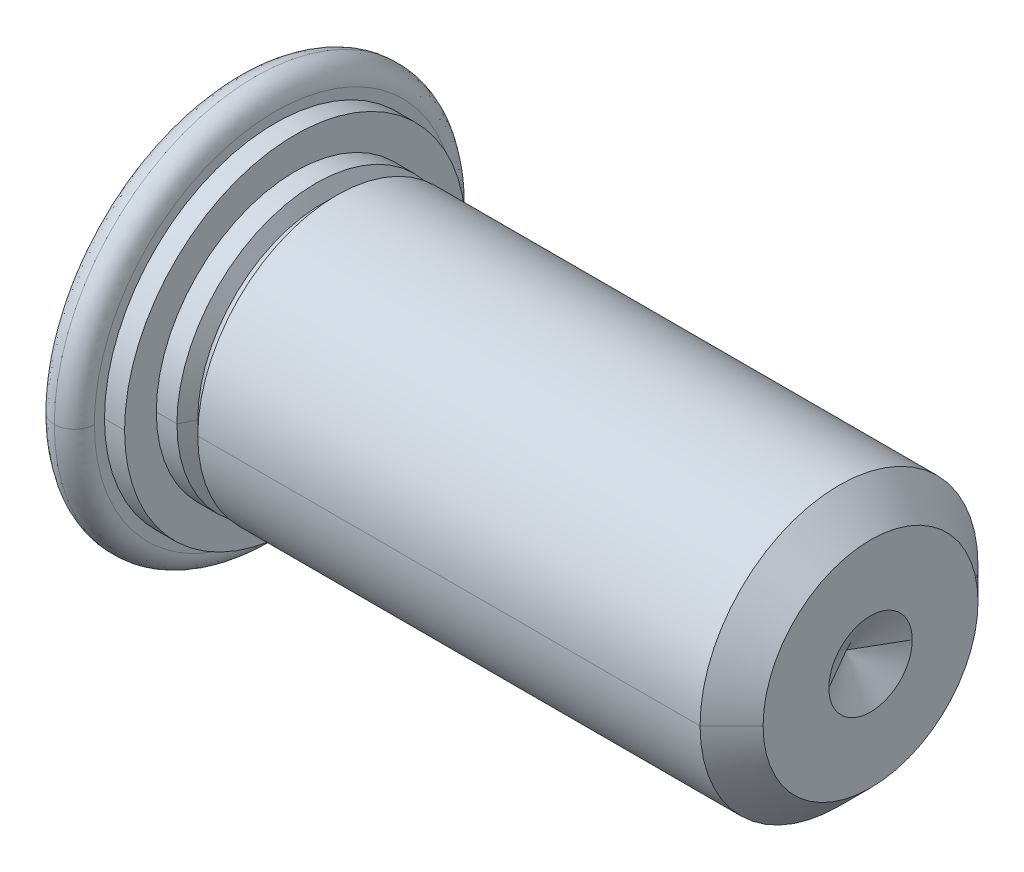
ISO-10303-21;
HEADER;
FILE_DESCRIPTION(('STEP AP214'),'2;1');
FILE_NAME('part.step','',(''),(''),'','','');
FILE_SCHEMA(('AUTOMOTIVE_DESIGN { 1 0 10303 214 1 1 1 1 }'));
ENDSEC;
DATA;
#1=APPLICATION_CONTEXT('core data for automotive mechanical design processes');
#2=APPLICATION_PROTOCOL_DEFINITION('international standard','automotive_design',2000,#1);
#3=PRODUCT_CONTEXT('',#1,'mechanical');
#4=PRODUCT('Part','Part','',(#3));
#5=PRODUCT_RELATED_PRODUCT_CATEGORY('part','',(#4));
#6=PRODUCT_DEFINITION_FORMATION('','',#4);
#7=PRODUCT_DEFINITION_CONTEXT('part definition',#1,'design');
#8=PRODUCT_DEFINITION('design','',#6,#7);
#9=PRODUCT_DEFINITION_SHAPE('','',#8);
#10=(LENGTH_UNIT() NAMED_UNIT(*) SI_UNIT(.MILLI.,.METRE.));
#11=(NAMED_UNIT(*) PLANE_ANGLE_UNIT() SI_UNIT($,.RADIAN.));
#12=(NAMED_UNIT(*) SI_UNIT($,.STERADIAN.) SOLID_ANGLE_UNIT());
#13=UNCERTAINTY_MEASURE_WITH_UNIT(LENGTH_MEASURE(1.E-05),#10,'distance_accuracy_value','');
#14=(GEOMETRIC_REPRESENTATION_CONTEXT(3) GLOBAL_UNCERTAINTY_ASSIGNED_CONTEXT((#13)) GLOBAL_UNIT_ASSIGNED_CONTEXT((#10,
#11,#12)) REPRESENTATION_CONTEXT('',''));
#15=CARTESIAN_POINT('',(0.,0.,0.));
#16=DIRECTION('',(0.,0.,1.));
#17=DIRECTION('',(1.,0.,0.));
#18=AXIS2_PLACEMENT_3D('',#15,#16,#17);
#19=CARTESIAN_POINT('',(1.41985999933917,0.,1.87452000255141));
#20=CARTESIAN_POINT('',(1.41985999933918,3.74904000510282,1.87452000255141));
#21=CARTESIAN_POINT('',(1.41985999933918,3.74904000510282,-1.87452000255141));
#22=CARTESIAN_POINT('',(1.41985999933917,0.,-1.87452000255141));
#23=CARTESIAN_POINT('',(1.38684894271597,0.,1.85546106044628));
#24=CARTESIAN_POINT('',(1.38684894271597,3.71092212089255,1.85546106044628));
#25=CARTESIAN_POINT('',(1.38684894271597,3.71092212089255,-1.85546106044628));
#26=CARTESIAN_POINT('',(1.38684894271597,0.,-1.85546106044628));
#27=CARTESIAN_POINT('',(1.34873105802194,0.,1.85546106031754));
#28=CARTESIAN_POINT('',(1.34873105802194,3.71092212063508,1.85546106031754));
#29=CARTESIAN_POINT('',(1.34873105802194,3.71092212063508,-1.85546106031754));
#30=CARTESIAN_POINT('',(1.34873105802194,0.,-1.85546106031754));
#31=CARTESIAN_POINT('',(1.31572000127,0.,1.87452000219971));
#32=CARTESIAN_POINT('',(1.31572000127,3.74904000439941,1.8745200021997));
#33=CARTESIAN_POINT('',(1.31572000127,3.74904000439941,-1.8745200021997));
#34=CARTESIAN_POINT('',(1.31572000127,0.,-1.87452000219971));
#35=(BOUNDED_SURFACE() B_SPLINE_SURFACE(3,3,((#19,#20,#21,#22),(#23,#24,#25,#26),(#27,#28,#29,
#30),(#31,#32,#33,#34)),.UNSPECIFIED.,.F.,.F.,.F.) B_SPLINE_SURFACE_WITH_KNOTS((4,4),(4,4),(0.,
1.),(0.,1.),.UNSPECIFIED.) GEOMETRIC_REPRESENTATION_ITEM() RATIONAL_B_SPLINE_SURFACE(((1.,
0.333333333333334,0.333333333333334,1.),(0.910683606091115,0.303561202030372,0.303561202030372,
0.910683606091115),(0.910683606091115,0.303561202030372,0.303561202030372,0.910683606091115),
(1.,0.333333333333334,0.333333333333334,1.))) REPRESENTATION_ITEM('') SURFACE());
#36=CARTESIAN_POINT('',(1.41985999997019,0.,0.));
#37=DIRECTION('',(1.,0.,0.));
#38=DIRECTION('',(0.,0.,-1.));
#39=AXIS2_PLACEMENT_3D('',#36,#37,#38);
#40=CIRCLE('',#39,1.87452000000121);
#41=CARTESIAN_POINT('',(1.41985999997019,0.,-1.87452000145847));
#42=VERTEX_POINT('',#41);
#43=CARTESIAN_POINT('',(1.41985999997019,1.87452000000121,0.));
#44=VERTEX_POINT('',#43);
#45=EDGE_CURVE('E41',#42,#44,#40,.T.);
#46=CARTESIAN_POINT('',(1.36779,0.,-1.96470788848305));
#47=DIRECTION('',(0.,-1.,0.));
#48=DIRECTION('',(0.,0.,-1.));
#49=AXIS2_PLACEMENT_3D('',#46,#47,#48);
#50=CIRCLE('',#49,0.10414);
#51=CARTESIAN_POINT('',(1.31572000127,0.,-1.87452000219971));
#52=VERTEX_POINT('',#51);
#53=EDGE_CURVE('E11',#42,#52,#50,.T.);
#54=CARTESIAN_POINT('',(1.31572000127,0.,0.));
#55=DIRECTION('',(-1.,0.,0.));
#56=DIRECTION('',(0.,0.,1.));
#57=AXIS2_PLACEMENT_3D('',#54,#55,#56);
#58=CIRCLE('',#57,1.87452000219971);
#59=CARTESIAN_POINT('',(1.31572000127,0.,1.87452000219971));
#60=VERTEX_POINT('',#59);
#61=EDGE_CURVE('E190',#60,#52,#58,.T.);
#62=CARTESIAN_POINT('',(1.36779,0.,1.96470788848305));
#63=DIRECTION('',(0.,1.,0.));
#64=DIRECTION('',(0.,0.,1.));
#65=AXIS2_PLACEMENT_3D('',#62,#63,#64);
#66=CIRCLE('',#65,0.10414);
#67=CARTESIAN_POINT('',(1.41985999997019,0.,1.87452000145847));
#68=VERTEX_POINT('',#67);
#69=EDGE_CURVE('E210',#68,#60,#66,.T.);
#70=CARTESIAN_POINT('',(1.41985999997019,0.,0.));
#71=DIRECTION('',(1.,0.,0.));
#72=DIRECTION('',(0.,0.,-1.));
#73=AXIS2_PLACEMENT_3D('',#70,#71,#72);
#74=CIRCLE('',#73,1.87452000000121);
#75=EDGE_CURVE('E186',#44,#68,#74,.T.);
#76=ORIENTED_EDGE('',*,*,#45,.F.);
#77=ORIENTED_EDGE('',*,*,#53,.T.);
#78=ORIENTED_EDGE('',*,*,#61,.F.);
#79=ORIENTED_EDGE('',*,*,#69,.F.);
#80=ORIENTED_EDGE('',*,*,#75,.F.);
#81=EDGE_LOOP('',(#76,#77,#78,#79,#80));
#82=FACE_BOUND('',#81,.T.);
#83=ADVANCED_FACE('F16',(#82),#35,.F.);
#84=CARTESIAN_POINT('',(0.30099,0.,-3.00993910280277));
#85=CARTESIAN_POINT('',(0.30099,-6.01987820560554,-3.00993910280277));
#86=CARTESIAN_POINT('',(0.30099,-6.01987820560554,3.00993910280277));
#87=CARTESIAN_POINT('',(0.30099,0.,3.00993910280277));
#88=CARTESIAN_POINT('',(0.47732402232425,0.,-3.00993910280277));
#89=CARTESIAN_POINT('',(0.477324022324249,-6.01987820560552,-3.00993910280277));
#90=CARTESIAN_POINT('',(0.477324022324249,-6.01987820560552,3.00993910280276));
#91=CARTESIAN_POINT('',(0.47732402232425,0.,3.00993910280277));
#92=CARTESIAN_POINT('',(0.60200290571081,0.,-2.88524402083668));
#93=CARTESIAN_POINT('',(0.602002905710809,-5.77048804167335,-2.88524402083668));
#94=CARTESIAN_POINT('',(0.602002905710809,-5.77048804167335,2.88524402083668));
#95=CARTESIAN_POINT('',(0.60200290571081,0.,2.88524402083668));
#96=CARTESIAN_POINT('',(0.60197999746,0.,-2.70891000000048));
#97=CARTESIAN_POINT('',(0.60197999746,-5.41782000000096,-2.70891000000048));
#98=CARTESIAN_POINT('',(0.60197999746,-5.41782000000097,2.70891000000048));
#99=CARTESIAN_POINT('',(0.60197999746,0.,2.70891000000048));
#100=(BOUNDED_SURFACE() B_SPLINE_SURFACE(3,3,((#84,#85,#86,#87),(#88,#89,#90,#91),(#92,#93,#94,
#95),(#96,#97,#98,#99)),.UNSPECIFIED.,.F.,.F.,.F.) B_SPLINE_SURFACE_WITH_KNOTS((4,4),(4,4),(0.,
1.),(0.,1.),.UNSPECIFIED.) GEOMETRIC_REPRESENTATION_ITEM() RATIONAL_B_SPLINE_SURFACE(((1.,
0.333333333333334,0.333333333333334,1.),(0.804707232116165,0.268235744038722,0.268235744038722,
0.804707232116165),(0.804707232116165,0.268235744038722,0.268235744038722,0.804707232116165),
(1.,0.333333333333334,0.333333333333334,1.))) REPRESENTATION_ITEM('') SURFACE());
#101=CARTESIAN_POINT('',(0.30099,0.,0.));
#102=DIRECTION('',(-1.,0.,0.));
#103=DIRECTION('',(0.,0.,1.));
#104=AXIS2_PLACEMENT_3D('',#101,#102,#103);
#105=CIRCLE('',#104,3.00993910280277);
#106=CARTESIAN_POINT('',(0.30099,0.,-3.00993910280277));
#107=VERTEX_POINT('',#106);
#108=CARTESIAN_POINT('',(0.30099,0.,3.00993910280277));
#109=VERTEX_POINT('',#108);
#110=EDGE_CURVE('E198',#107,#109,#105,.T.);
#111=CARTESIAN_POINT('',(0.30099,0.,-2.70894910280277));
#112=DIRECTION('',(0.,-1.,0.));
#113=DIRECTION('',(0.,0.,-1.));
#114=AXIS2_PLACEMENT_3D('',#111,#112,#113);
#115=CIRCLE('',#114,0.30099);
#116=CARTESIAN_POINT('',(0.601979997968,0.,-2.70891000000042));
#117=VERTEX_POINT('',#116);
#118=EDGE_CURVE('E27',#107,#117,#115,.T.);
#119=CARTESIAN_POINT('',(0.601979997968,0.,2.70891000000042));
#120=CARTESIAN_POINT('',(0.60197999873,-0.172146495770327,2.70891000000033));
#121=CARTESIAN_POINT('',(0.60197999873,-0.425898297557994,2.6851353533292));
#122=CARTESIAN_POINT('',(0.60197999873,-0.714123168041582,2.61579263387176));
#123=CARTESIAN_POINT('',(0.60197999873,-0.856280878716203,2.57071986622442));
#124=CARTESIAN_POINT('',(0.60197999873,-0.91678674231236,2.54917409267871));
#125=CARTESIAN_POINT('',(0.60197999873,-0.957030902587552,2.53431493850926));
#126=CARTESIAN_POINT('',(0.60197999873,-0.975419148248615,2.52730532096344));
#127=CARTESIAN_POINT('',(0.60197999873,-1.34459610257155,2.38123291731776));
#128=CARTESIAN_POINT('',(0.60197999873,-1.65121072516083,2.17966149054652));
#129=CARTESIAN_POINT('',(0.60197999873,-2.04762758335602,1.78340220066317));
#130=CARTESIAN_POINT('',(0.60197999873,-2.2221348224057,1.56954322932422));
#131=CARTESIAN_POINT('',(0.60197999873,-2.38424951871313,1.2925147749002));
#132=CARTESIAN_POINT('',(0.60197999873,-2.45493759622089,1.14711896738939));
#133=CARTESIAN_POINT('',(0.60197999873,-2.48301050001436,1.08333185410644));
#134=CARTESIAN_POINT('',(0.60197999873,-2.50123199441735,1.04047941761787));
#135=CARTESIAN_POINT('',(0.60197999873,-2.51079216389402,1.017131488907));
#136=CARTESIAN_POINT('',(0.60197999873,-2.64544343042842,0.677198652037437));
#137=CARTESIAN_POINT('',(0.60197999873,-2.70884262477299,0.34412271036082));
#138=CARTESIAN_POINT('',(0.60197999873,-2.70894368761399,-0.17206135518041));
#139=CARTESIAN_POINT('',(0.60197999873,-2.68519430665312,-0.425749301525639));
#140=CARTESIAN_POINT('',(0.60197999873,-2.61583684886469,-0.714011421017316));
#141=CARTESIAN_POINT('',(0.60197999873,-2.57074565830363,-0.856215692952048));
#142=CARTESIAN_POINT('',(0.60197999873,-2.54918962056314,-0.916747497821696));
#143=CARTESIAN_POINT('',(0.60197999873,-2.53432309722819,-0.957010282600932));
#144=CARTESIAN_POINT('',(0.60197999873,-2.52730532096344,-0.975419148248602));
#145=CARTESIAN_POINT('',(0.60197999873,-2.38123291731771,-1.34459610257174));
#146=CARTESIAN_POINT('',(0.60197999873,-2.17966149054589,-1.65121072516161));
#147=CARTESIAN_POINT('',(0.60197999873,-1.78340220066348,-2.04762758335563));
#148=CARTESIAN_POINT('',(0.60197999873,-1.56954322932476,-2.22213482240501));
#149=CARTESIAN_POINT('',(0.60197999873,-1.29251477490062,-2.38424951871262));
#150=CARTESIAN_POINT('',(0.601979998730001,-1.14711896738963,-2.45493759622059));
#151=CARTESIAN_POINT('',(0.60197999873,-1.08333185410659,-2.48301050001418));
#152=CARTESIAN_POINT('',(0.60197999873,-1.04047941761794,-2.50123199441725));
#153=CARTESIAN_POINT('',(0.60197999873,-1.01714214117938,-2.51078794440763));
#154=CARTESIAN_POINT('',(0.60197999873,-0.677028215679255,-2.64551094221066));
#155=CARTESIAN_POINT('',(0.60197999873,-0.34464973578613,-2.70891000000033));
#156=CARTESIAN_POINT('',(0.601979997968,0.,-2.70891000000042));
#157=(BOUNDED_CURVE() B_SPLINE_CURVE(3,(#119,#120,#121,#122,#123,#124,#125,#126,#127,#128,#129,
#130,#131,#132,#133,#134,#135,#136,#137,#138,#139,#140,#141,#142,#143,#144,#145,#146,#147,#148,
#149,#150,#151,#152,#153,#154,#155,#156),.UNSPECIFIED.,.F.,.F.) B_SPLINE_CURVE_WITH_KNOTS((4,1,
1,1,2,2,2,1,1,1,2,2,2,1,1,1,2,2,2,1,1,1,2,2,4),(0.,0.0625,0.09375,0.109375,0.1171875,0.125,0.25,
0.3125,0.34375,0.359375,0.3671875,0.375,0.5,0.5625,0.59375,0.609375,0.6171875,0.625,0.75,0.8125,
0.84375,0.859375,0.8671875,0.875,1.),
.UNSPECIFIED.) CURVE() GEOMETRIC_REPRESENTATION_ITEM() RATIONAL_B_SPLINE_CURVE((1.,1.,1.,1.,1.,
1.,1.,1.,1.,1.,1.,1.,1.,1.,1.,1.,1.,1.,1.,1.,1.,1.,1.,1.,1.,1.,1.,1.,1.,1.,1.,1.,1.,1.,1.,1.,1.,1.)) REPRESENTATION_ITEM(''));
#158=CARTESIAN_POINT('',(0.601979997968,0.,2.70891000000042));
#159=VERTEX_POINT('',#158);
#160=EDGE_CURVE('E203',#159,#117,#157,.T.);
#161=CARTESIAN_POINT('',(0.30099,0.,2.70894910280277));
#162=DIRECTION('',(0.,1.,0.));
#163=DIRECTION('',(0.,0.,1.));
#164=AXIS2_PLACEMENT_3D('',#161,#162,#163);
#165=CIRCLE('',#164,0.30099);
#166=EDGE_CURVE('E200',#109,#159,#165,.T.);
#167=ORIENTED_EDGE('',*,*,#110,.F.);
#168=ORIENTED_EDGE('',*,*,#118,.T.);
#169=ORIENTED_EDGE('',*,*,#160,.F.);
#170=ORIENTED_EDGE('',*,*,#166,.F.);
#171=EDGE_LOOP('',(#167,#168,#169,#170));
#172=FACE_BOUND('',#171,.T.);
#173=ADVANCED_FACE('F365',(#172),#100,.T.);
#174=CARTESIAN_POINT('',(2.54000011128131E-09,0.,-2.70891000000033));
#175=CARTESIAN_POINT('',(2.5400001112813E-09,-5.41782000000066,-2.70891000000033));
#176=CARTESIAN_POINT('',(2.53999977954646E-09,-5.41782000000066,2.70891000000033));
#177=CARTESIAN_POINT('',(2.53999977954647E-09,0.,2.70891000000033));
#178=CARTESIAN_POINT('',(-2.29057108997583E-05,0.,-2.8852440208366));
#179=CARTESIAN_POINT('',(-2.29057108997583E-05,-5.77048804167319,-2.8852440208366));
#180=CARTESIAN_POINT('',(-2.29057109001116E-05,-5.77048804167319,2.8852440208366));
#181=CARTESIAN_POINT('',(-2.29057109001116E-05,0.,2.8852440208366));
#182=CARTESIAN_POINT('',(0.12465597767568,0.,-3.00993910280277));
#183=CARTESIAN_POINT('',(0.124655977675679,-6.01987820560553,-3.00993910280277));
#184=CARTESIAN_POINT('',(0.124655977675679,-6.01987820560553,3.00993910280277));
#185=CARTESIAN_POINT('',(0.124655977675679,0.,3.00993910280277));
#186=CARTESIAN_POINT('',(0.30099,0.,-3.00993910280277));
#187=CARTESIAN_POINT('',(0.30099,-6.01987820560554,-3.00993910280277));
#188=CARTESIAN_POINT('',(0.30099,-6.01987820560554,3.00993910280277));
#189=CARTESIAN_POINT('',(0.30099,0.,3.00993910280277));
#190=(BOUNDED_SURFACE() B_SPLINE_SURFACE(3,3,((#174,#175,#176,#177),(#178,#179,#180,#181),(#182,
#183,#184,#185),(#186,#187,#188,#189)),.UNSPECIFIED.,.F.,.F.,
.F.) B_SPLINE_SURFACE_WITH_KNOTS((4,4),(4,4),(0.,1.),(0.,1.),
.UNSPECIFIED.) GEOMETRIC_REPRESENTATION_ITEM() RATIONAL_B_SPLINE_SURFACE(((1.,0.333333333333334,
0.333333333333334,1.),(0.804707232116045,0.268235744038682,0.268235744038682,0.804707232116045),
(0.804707232116045,0.268235744038682,0.268235744038682,0.804707232116045),(1.,0.333333333333334,
0.333333333333334,1.))) REPRESENTATION_ITEM('') SURFACE());
#191=CARTESIAN_POINT('',(1.52399987161239E-09,0.,2.7089100000002));
#192=CARTESIAN_POINT('',(2.53999978602065E-09,-5.41782000000066,2.70891000000033));
#193=CARTESIAN_POINT('',(2.5400001112813E-09,-5.41782000000066,-2.70891000000033));
#194=CARTESIAN_POINT('',(1.52400020205239E-09,0.,-2.7089100000002));
#195=(BOUNDED_CURVE() B_SPLINE_CURVE(3,(#191,#192,#193,#194),.UNSPECIFIED.,.F.,
.F.) B_SPLINE_CURVE_WITH_KNOTS((4,4),(0.,1.),
.UNSPECIFIED.) CURVE() GEOMETRIC_REPRESENTATION_ITEM() RATIONAL_B_SPLINE_CURVE((1.,
0.333333333333334,0.333333333333334,1.)) REPRESENTATION_ITEM(''));
#196=CARTESIAN_POINT('',(1.52399987161239E-09,0.,2.7089100000002));
#197=VERTEX_POINT('',#196);
#198=CARTESIAN_POINT('',(1.52400020205239E-09,0.,-2.7089100000002));
#199=VERTEX_POINT('',#198);
#200=EDGE_CURVE('E249',#197,#199,#195,.T.);
#201=CARTESIAN_POINT('',(0.30099,0.,-2.70894910280277));
#202=DIRECTION('',(0.,-1.,0.));
#203=DIRECTION('',(0.,0.,-1.));
#204=AXIS2_PLACEMENT_3D('',#201,#202,#203);
#205=CIRCLE('',#204,0.30099);
#206=EDGE_CURVE('E255',#199,#107,#205,.T.);
#207=CARTESIAN_POINT('',(0.30099,0.,2.70894910280277));
#208=DIRECTION('',(0.,1.,0.));
#209=DIRECTION('',(0.,0.,1.));
#210=AXIS2_PLACEMENT_3D('',#207,#208,#209);
#211=CIRCLE('',#210,0.30099);
#212=EDGE_CURVE('E308',#197,#109,#211,.T.);
#213=ORIENTED_EDGE('',*,*,#200,.T.);
#214=ORIENTED_EDGE('',*,*,#206,.T.);
#215=ORIENTED_EDGE('',*,*,#110,.T.);
#216=ORIENTED_EDGE('',*,*,#212,.F.);
#217=EDGE_LOOP('',(#213,#214,#215,#216));
#218=FACE_BOUND('',#217,.T.);
#219=ADVANCED_FACE('F375',(#218),#190,.T.);
#220=CARTESIAN_POINT('',(4.82727,0.,0.));
#221=DIRECTION('',(-1.,0.,0.));
#222=DIRECTION('',(0.,0.,1.));
#223=AXIS2_PLACEMENT_3D('',#220,#221,#222);
#224=CYLINDRICAL_SURFACE('',#223,2.0828);
#225=CARTESIAN_POINT('',(9.05256,0.,0.));
#226=DIRECTION('',(-1.,0.,0.));
#227=DIRECTION('',(0.,0.,1.));
#228=AXIS2_PLACEMENT_3D('',#225,#226,#227);
#229=CIRCLE('',#228,2.0828);
#230=CARTESIAN_POINT('',(9.05256,0.,2.08280000008253));
#231=VERTEX_POINT('',#230);
#232=CARTESIAN_POINT('',(9.05256,0.,-2.08280000008253));
#233=VERTEX_POINT('',#232);
#234=EDGE_CURVE('E194',#231,#233,#229,.T.);
#235=ORIENTED_EDGE('',*,*,#234,.T.);
#236=DIRECTION('',(-1.,0.,0.));
#237=VECTOR('',#236,1.);
#238=CARTESIAN_POINT('',(4.82727,0.,-2.0828));
#239=LINE('',#238,#237);
#240=CARTESIAN_POINT('',(1.524,0.,-2.0828));
#241=VERTEX_POINT('',#240);
#242=EDGE_CURVE('E199',#233,#241,#239,.T.);
#243=ORIENTED_EDGE('',*,*,#242,.T.);
#244=CARTESIAN_POINT('',(1.524,0.,0.));
#245=DIRECTION('',(1.,0.,0.));
#246=DIRECTION('',(0.,0.,1.));
#247=AXIS2_PLACEMENT_3D('',#244,#245,#246);
#248=CIRCLE('',#247,2.0828);
#249=CARTESIAN_POINT('',(1.524,2.08280000006084,0.));
#250=VERTEX_POINT('',#249);
#251=EDGE_CURVE('E185',#241,#250,#248,.T.);
#252=ORIENTED_EDGE('',*,*,#251,.T.);
#253=CARTESIAN_POINT('',(1.524,0.,0.));
#254=DIRECTION('',(1.,0.,0.));
#255=DIRECTION('',(0.,0.,1.));
#256=AXIS2_PLACEMENT_3D('',#253,#254,#255);
#257=CIRCLE('',#256,2.0828);
#258=CARTESIAN_POINT('',(1.524,0.,2.0828));
#259=VERTEX_POINT('',#258);
#260=EDGE_CURVE('E181',#250,#259,#257,.T.);
#261=ORIENTED_EDGE('',*,*,#260,.T.);
#262=DIRECTION('',(-1.,0.,0.));
#263=VECTOR('',#262,1.);
#264=CARTESIAN_POINT('',(4.82727,0.,2.0828));
#265=LINE('',#264,#263);
#266=EDGE_CURVE('E276',#231,#259,#265,.T.);
#267=ORIENTED_EDGE('',*,*,#266,.F.);
#268=EDGE_LOOP('',(#235,#243,#252,#261,#267));
#269=FACE_BOUND('',#268,.T.);
#270=ADVANCED_FACE('F555',(#269),#224,.T.);
#271=CARTESIAN_POINT('',(1.52399999987551,0.,0.));
#272=DIRECTION('',(1.,0.,0.));
#273=DIRECTION('',(0.,1.,0.));
#274=AXIS2_PLACEMENT_3D('',#271,#272,#273);
#275=CONICAL_SURFACE('',#274,2.08279999981187,1.10714871779409);
#276=ORIENTED_EDGE('',*,*,#75,.T.);
#277=CARTESIAN_POINT('',(1.41985999997019,0.,0.));
#278=DIRECTION('',(1.,0.,0.));
#279=DIRECTION('',(0.,0.,-1.));
#280=AXIS2_PLACEMENT_3D('',#277,#278,#279);
#281=CIRCLE('',#280,1.87452000000121);
#282=CARTESIAN_POINT('',(1.41985999997019,-1.87452000000121,0.));
#283=VERTEX_POINT('',#282);
#284=EDGE_CURVE('E265',#68,#283,#281,.T.);
#285=ORIENTED_EDGE('',*,*,#284,.T.);
#286=DIRECTION('',(0.447213595499958,-0.894427190999916,0.));
#287=VECTOR('',#286,1.);
#288=CARTESIAN_POINT('',(1.52399999987551,-2.08279999981187,0.));
#289=LINE('',#288,#287);
#290=CARTESIAN_POINT('',(1.524,-2.08280000006084,0.));
#291=VERTEX_POINT('',#290);
#292=EDGE_CURVE('E269',#283,#291,#289,.T.);
#293=ORIENTED_EDGE('',*,*,#292,.T.);
#294=CARTESIAN_POINT('',(1.524,0.,0.));
#295=DIRECTION('',(1.,0.,0.));
#296=DIRECTION('',(0.,0.,1.));
#297=AXIS2_PLACEMENT_3D('',#294,#295,#296);
#298=CIRCLE('',#297,2.0828);
#299=EDGE_CURVE('E272',#259,#291,#298,.T.);
#300=ORIENTED_EDGE('',*,*,#299,.F.);
#301=ORIENTED_EDGE('',*,*,#260,.F.);
#302=DIRECTION('',(0.447213595499958,0.894427190999916,0.));
#303=VECTOR('',#302,1.);
#304=CARTESIAN_POINT('',(1.52399999987551,2.08279999981187,0.));
#305=LINE('',#304,#303);
#306=EDGE_CURVE('E230',#44,#250,#305,.T.);
#307=ORIENTED_EDGE('',*,*,#306,.F.);
#308=EDGE_LOOP('',(#276,#285,#293,#300,#301,#307));
#309=FACE_BOUND('',#308,.T.);
#310=ADVANCED_FACE('F550',(#309),#275,.T.);
#311=CARTESIAN_POINT('',(9.05255999998644,0.,0.));
#312=DIRECTION('',(-1.,0.,0.));
#313=DIRECTION('',(0.,0.,1.));
#314=AXIS2_PLACEMENT_3D('',#311,#312,#313);
#315=CONICAL_SURFACE('',#314,2.08280000009609,0.785398163397448);
#316=CARTESIAN_POINT('',(9.52499999993961,0.,0.));
#317=DIRECTION('',(-1.,0.,0.));
#318=DIRECTION('',(0.,0.,1.));
#319=AXIS2_PLACEMENT_3D('',#316,#317,#318);
#320=CIRCLE('',#319,1.61036000014292);
#321=CARTESIAN_POINT('',(9.52499999993961,0.,1.61036000014292));
#322=VERTEX_POINT('',#321);
#323=CARTESIAN_POINT('',(9.52499999993961,0.,-1.61036000014291));
#324=VERTEX_POINT('',#323);
#325=EDGE_CURVE('E288',#322,#324,#320,.T.);
#326=ORIENTED_EDGE('',*,*,#325,.T.);
#327=DIRECTION('',(-0.707106781186548,0.,-0.707106781186547));
#328=VECTOR('',#327,1.);
#329=CARTESIAN_POINT('',(9.05255999998644,0.,-2.08280000009609));
#330=LINE('',#329,#328);
#331=EDGE_CURVE('E217',#324,#233,#330,.T.);
#332=ORIENTED_EDGE('',*,*,#331,.T.);
#333=ORIENTED_EDGE('',*,*,#234,.F.);
#334=DIRECTION('',(-0.707106781186548,0.,0.707106781186547));
#335=VECTOR('',#334,1.);
#336=CARTESIAN_POINT('',(9.05255999998644,0.,2.08280000009609));
#337=LINE('',#336,#335);
#338=EDGE_CURVE('E224',#322,#231,#337,.T.);
#339=ORIENTED_EDGE('',*,*,#338,.F.);
#340=EDGE_LOOP('',(#326,#332,#333,#339));
#341=FACE_BOUND('',#340,.T.);
#342=ADVANCED_FACE('F554',(#341),#315,.T.);
#343=CARTESIAN_POINT('',(9.52499999993961,0.,0.));
#344=DIRECTION('',(1.,0.,0.));
#345=DIRECTION('',(0.,0.,-1.));
#346=AXIS2_PLACEMENT_3D('',#343,#344,#345);
#347=CONICAL_SURFACE('',#346,0.624839999886717,1.04719755065132);
#348=DIRECTION('',(0.500000000472225,0.,-0.8660254035118));
#349=VECTOR('',#348,1.);
#350=CARTESIAN_POINT('',(9.52499999993961,0.,-0.624839999886717));
#351=LINE('',#350,#349);
#352=CARTESIAN_POINT('',(9.1642484576937,0.,3.97903932025656E-10));
#353=VERTEX_POINT('',#352);
#354=CARTESIAN_POINT('',(9.52499999990679,0.,-0.624839999829873));
#355=VERTEX_POINT('',#354);
#356=EDGE_CURVE('E214',#353,#355,#351,.T.);
#357=ORIENTED_EDGE('',*,*,#356,.F.);
#358=DIRECTION('',(0.500000000472225,0.,0.8660254035118));
#359=VECTOR('',#358,1.);
#360=CARTESIAN_POINT('',(9.52499999993961,0.,0.624839999886717));
#361=LINE('',#360,#359);
#362=CARTESIAN_POINT('',(9.52499999990679,0.,0.624839999829873));
#363=VERTEX_POINT('',#362);
#364=EDGE_CURVE('E193',#353,#363,#361,.T.);
#365=ORIENTED_EDGE('',*,*,#364,.T.);
#366=CARTESIAN_POINT('',(9.52499999990679,0.,0.));
#367=DIRECTION('',(-1.,0.,0.));
#368=DIRECTION('',(0.,0.,-1.));
#369=AXIS2_PLACEMENT_3D('',#366,#367,#368);
#370=CIRCLE('',#369,0.624839999829874);
#371=EDGE_CURVE('E207',#355,#363,#370,.T.);
#372=ORIENTED_EDGE('',*,*,#371,.F.);
#373=EDGE_LOOP('',(#357,#365,#372));
#374=FACE_BOUND('',#373,.T.);
#375=ADVANCED_FACE('F591',(#374),#347,.F.);
#376=CARTESIAN_POINT('',(1.21158000092691,0.,0.));
#377=DIRECTION('',(-1.,0.,0.));
#378=DIRECTION('',(0.,0.,1.));
#379=AXIS2_PLACEMENT_3D('',#376,#377,#378);
#380=CONICAL_SURFACE('',#379,2.08280000043715,1.10714871790326);
#381=ORIENTED_EDGE('',*,*,#61,.T.);
#382=DIRECTION('',(-0.447213595402316,0.,-0.894427191048737));
#383=VECTOR('',#382,1.);
#384=CARTESIAN_POINT('',(1.21158000092691,0.,-2.08280000043715));
#385=LINE('',#384,#383);
#386=CARTESIAN_POINT('',(1.21158000092691,0.,-2.08280000043715));
#387=VERTEX_POINT('',#386);
#388=EDGE_CURVE('E167',#52,#387,#385,.T.);
#389=ORIENTED_EDGE('',*,*,#388,.T.);
#390=CARTESIAN_POINT('',(1.21158000092691,0.,0.));
#391=DIRECTION('',(1.,0.,0.));
#392=DIRECTION('',(0.,0.,-1.));
#393=AXIS2_PLACEMENT_3D('',#390,#391,#392);
#394=CIRCLE('',#393,2.08280000043715);
#395=CARTESIAN_POINT('',(1.21158000092691,0.,2.08280000043715));
#396=VERTEX_POINT('',#395);
#397=EDGE_CURVE('E144',#387,#396,#394,.T.);
#398=ORIENTED_EDGE('',*,*,#397,.T.);
#399=DIRECTION('',(-0.447213595402316,0.,0.894427191048737));
#400=VECTOR('',#399,1.);
#401=CARTESIAN_POINT('',(1.21158000092691,0.,2.08280000043715));
#402=LINE('',#401,#400);
#403=EDGE_CURVE('E158',#60,#396,#402,.T.);
#404=ORIENTED_EDGE('',*,*,#403,.F.);
#405=EDGE_LOOP('',(#381,#389,#398,#404));
#406=FACE_BOUND('',#405,.T.);
#407=ADVANCED_FACE('F18',(#406),#380,.T.);
#408=CARTESIAN_POINT('',(4.82727,0.,0.));
#409=DIRECTION('',(-1.,0.,0.));
#410=DIRECTION('',(0.,0.,1.));
#411=AXIS2_PLACEMENT_3D('',#408,#409,#410);
#412=CYLINDRICAL_SURFACE('',#411,2.0828);
#413=ORIENTED_EDGE('',*,*,#397,.F.);
#414=DIRECTION('',(-1.,0.,0.));
#415=VECTOR('',#414,1.);
#416=CARTESIAN_POINT('',(4.82727,0.,-2.0828));
#417=LINE('',#416,#415);
#418=CARTESIAN_POINT('',(0.90297,0.,-2.0828));
#419=VERTEX_POINT('',#418);
#420=EDGE_CURVE('E169',#387,#419,#417,.T.);
#421=ORIENTED_EDGE('',*,*,#420,.T.);
#422=CARTESIAN_POINT('',(0.90297,0.,0.));
#423=DIRECTION('',(1.,0.,0.));
#424=DIRECTION('',(0.,0.,1.));
#425=AXIS2_PLACEMENT_3D('',#422,#423,#424);
#426=CIRCLE('',#425,2.0828);
#427=CARTESIAN_POINT('',(0.90297,0.,2.0828));
#428=VERTEX_POINT('',#427);
#429=EDGE_CURVE('E146',#419,#428,#426,.T.);
#430=ORIENTED_EDGE('',*,*,#429,.T.);
#431=DIRECTION('',(-1.,0.,0.));
#432=VECTOR('',#431,1.);
#433=CARTESIAN_POINT('',(4.82727,0.,2.0828));
#434=LINE('',#433,#432);
#435=EDGE_CURVE('E139',#396,#428,#434,.T.);
#436=ORIENTED_EDGE('',*,*,#435,.F.);
#437=EDGE_LOOP('',(#413,#421,#430,#436));
#438=FACE_BOUND('',#437,.T.);
#439=ADVANCED_FACE('F141',(#438),#412,.T.);
#440=CARTESIAN_POINT('',(0.752475,0.,0.));
#441=DIRECTION('',(1.,0.,0.));
#442=DIRECTION('',(0.,0.,-1.));
#443=AXIS2_PLACEMENT_3D('',#440,#441,#442);
#444=CYLINDRICAL_SURFACE('',#443,2.558415);
#445=CARTESIAN_POINT('',(0.601979998730001,0.,0.));
#446=DIRECTION('',(1.,0.,0.));
#447=DIRECTION('',(0.,0.,-1.));
#448=AXIS2_PLACEMENT_3D('',#445,#446,#447);
#449=CIRCLE('',#448,2.558415);
#450=CARTESIAN_POINT('',(0.601979998730001,0.,-2.558415));
#451=VERTEX_POINT('',#450);
#452=CARTESIAN_POINT('',(0.60197999873,0.,2.558415));
#453=VERTEX_POINT('',#452);
#454=EDGE_CURVE('E263',#451,#453,#449,.T.);
#455=ORIENTED_EDGE('',*,*,#454,.T.);
#456=DIRECTION('',(1.,0.,0.));
#457=VECTOR('',#456,1.);
#458=CARTESIAN_POINT('',(0.752475,0.,2.558415));
#459=LINE('',#458,#457);
#460=CARTESIAN_POINT('',(0.90297,0.,2.558415));
#461=VERTEX_POINT('',#460);
#462=EDGE_CURVE('E256',#453,#461,#459,.T.);
#463=ORIENTED_EDGE('',*,*,#462,.T.);
#464=CARTESIAN_POINT('',(0.90297,0.,0.));
#465=DIRECTION('',(1.,0.,0.));
#466=DIRECTION('',(0.,0.,-1.));
#467=AXIS2_PLACEMENT_3D('',#464,#465,#466);
#468=CIRCLE('',#467,2.558415);
#469=CARTESIAN_POINT('',(0.90297,0.,-2.558415));
#470=VERTEX_POINT('',#469);
#471=EDGE_CURVE('E189',#470,#461,#468,.T.);
#472=ORIENTED_EDGE('',*,*,#471,.F.);
#473=DIRECTION('',(1.,0.,0.));
#474=VECTOR('',#473,1.);
#475=CARTESIAN_POINT('',(0.752475,0.,-2.558415));
#476=LINE('',#475,#474);
#477=EDGE_CURVE('E20',#451,#470,#476,.T.);
#478=ORIENTED_EDGE('',*,*,#477,.F.);
#479=EDGE_LOOP('',(#455,#463,#472,#478));
#480=FACE_BOUND('',#479,.T.);
#481=ADVANCED_FACE('F402',(#480),#444,.T.);
#482=CARTESIAN_POINT('',(2.53999978602065E-09,0.,2.70891000000033));
#483=CARTESIAN_POINT('',(2.53999978602065E-09,5.41782000000066,2.70891000000033));
#484=CARTESIAN_POINT('',(2.54000011775549E-09,5.41782000000066,-2.70891000000033));
#485=CARTESIAN_POINT('',(2.54000011775549E-09,0.,-2.70891000000033));
#486=CARTESIAN_POINT('',(-2.29057108999485E-05,0.,2.8852440208366));
#487=CARTESIAN_POINT('',(-2.29057108999485E-05,5.77048804167321,2.8852440208366));
#488=CARTESIAN_POINT('',(-2.29057108995952E-05,5.77048804167321,-2.8852440208366));
#489=CARTESIAN_POINT('',(-2.29057108995952E-05,0.,-2.8852440208366));
#490=CARTESIAN_POINT('',(0.124655977675679,0.,3.00993910280277));
#491=CARTESIAN_POINT('',(0.124655977675679,6.01987820560553,3.00993910280277));
#492=CARTESIAN_POINT('',(0.12465597767568,6.01987820560553,-3.00993910280277));
#493=CARTESIAN_POINT('',(0.12465597767568,0.,-3.00993910280277));
#494=CARTESIAN_POINT('',(0.30099,0.,3.00993910280277));
#495=CARTESIAN_POINT('',(0.30099,6.01987820560554,3.00993910280277));
#496=CARTESIAN_POINT('',(0.30099,6.01987820560554,-3.00993910280277));
#497=CARTESIAN_POINT('',(0.30099,0.,-3.00993910280277));
#498=(BOUNDED_SURFACE() B_SPLINE_SURFACE(3,3,((#482,#483,#484,#485),(#486,#487,#488,#489),(#490,
#491,#492,#493),(#494,#495,#496,#497)),.UNSPECIFIED.,.F.,.F.,
.F.) B_SPLINE_SURFACE_WITH_KNOTS((4,4),(4,4),(0.,1.),(0.,1.),
.UNSPECIFIED.) GEOMETRIC_REPRESENTATION_ITEM() RATIONAL_B_SPLINE_SURFACE(((1.,0.333333333333334,
0.333333333333334,1.),(0.804707232116045,0.268235744038682,0.268235744038682,0.804707232116045),
(0.804707232116045,0.268235744038682,0.268235744038682,0.804707232116045),(1.,0.333333333333334,
0.333333333333334,1.))) REPRESENTATION_ITEM('') SURFACE());
#499=CARTESIAN_POINT('',(1.52400020205239E-09,0.,-2.7089100000002));
#500=CARTESIAN_POINT('',(2.5400001112813E-09,5.41782000000066,-2.70891000000033));
#501=CARTESIAN_POINT('',(2.53999978602065E-09,5.41782000000066,2.70891000000033));
#502=CARTESIAN_POINT('',(1.52399987161239E-09,0.,2.7089100000002));
#503=(BOUNDED_CURVE() B_SPLINE_CURVE(3,(#499,#500,#501,#502),.UNSPECIFIED.,.F.,
.F.) B_SPLINE_CURVE_WITH_KNOTS((4,4),(0.,1.),
.UNSPECIFIED.) CURVE() GEOMETRIC_REPRESENTATION_ITEM() RATIONAL_B_SPLINE_CURVE((1.,
0.333333333333334,0.333333333333334,1.)) REPRESENTATION_ITEM(''));
#504=EDGE_CURVE('E264',#199,#197,#503,.T.);
#505=CARTESIAN_POINT('',(0.30099,0.,0.));
#506=DIRECTION('',(-1.,0.,0.));
#507=DIRECTION('',(0.,0.,1.));
#508=AXIS2_PLACEMENT_3D('',#505,#506,#507);
#509=CIRCLE('',#508,3.00993910280277);
#510=EDGE_CURVE('E293',#109,#107,#509,.T.);
#511=ORIENTED_EDGE('',*,*,#206,.F.);
#512=ORIENTED_EDGE('',*,*,#504,.T.);
#513=ORIENTED_EDGE('',*,*,#212,.T.);
#514=ORIENTED_EDGE('',*,*,#510,.T.);
#515=EDGE_LOOP('',(#511,#512,#513,#514));
#516=FACE_BOUND('',#515,.T.);
#517=ADVANCED_FACE('F371',(#516),#498,.T.);
#518=CARTESIAN_POINT('',(4.82727,0.,0.));
#519=DIRECTION('',(-1.,0.,0.));
#520=DIRECTION('',(0.,0.,1.));
#521=AXIS2_PLACEMENT_3D('',#518,#519,#520);
#522=CYLINDRICAL_SURFACE('',#521,2.0828);
#523=ORIENTED_EDGE('',*,*,#242,.F.);
#524=CARTESIAN_POINT('',(9.05256,0.,0.));
#525=DIRECTION('',(-1.,0.,0.));
#526=DIRECTION('',(0.,0.,1.));
#527=AXIS2_PLACEMENT_3D('',#524,#525,#526);
#528=CIRCLE('',#527,2.0828);
#529=EDGE_CURVE('E289',#233,#231,#528,.T.);
#530=ORIENTED_EDGE('',*,*,#529,.T.);
#531=ORIENTED_EDGE('',*,*,#266,.T.);
#532=ORIENTED_EDGE('',*,*,#299,.T.);
#533=CARTESIAN_POINT('',(1.524,0.,0.));
#534=DIRECTION('',(1.,0.,0.));
#535=DIRECTION('',(0.,0.,1.));
#536=AXIS2_PLACEMENT_3D('',#533,#534,#535);
#537=CIRCLE('',#536,2.0828);
#538=EDGE_CURVE('E223',#291,#241,#537,.T.);
#539=ORIENTED_EDGE('',*,*,#538,.T.);
#540=EDGE_LOOP('',(#523,#530,#531,#532,#539));
#541=FACE_BOUND('',#540,.T.);
#542=ADVANCED_FACE('F601',(#541),#522,.T.);
#543=CARTESIAN_POINT('',(1.52399999987551,0.,0.));
#544=DIRECTION('',(1.,0.,0.));
#545=DIRECTION('',(0.,1.,0.));
#546=AXIS2_PLACEMENT_3D('',#543,#544,#545);
#547=CONICAL_SURFACE('',#546,2.08279999981187,1.10714871779409);
#548=ORIENTED_EDGE('',*,*,#292,.F.);
#549=CARTESIAN_POINT('',(1.41985999997019,0.,0.));
#550=DIRECTION('',(1.,0.,0.));
#551=DIRECTION('',(0.,0.,-1.));
#552=AXIS2_PLACEMENT_3D('',#549,#550,#551);
#553=CIRCLE('',#552,1.87452000000121);
#554=EDGE_CURVE('E219',#283,#42,#553,.T.);
#555=ORIENTED_EDGE('',*,*,#554,.T.);
#556=ORIENTED_EDGE('',*,*,#45,.T.);
#557=ORIENTED_EDGE('',*,*,#306,.T.);
#558=ORIENTED_EDGE('',*,*,#251,.F.);
#559=ORIENTED_EDGE('',*,*,#538,.F.);
#560=EDGE_LOOP('',(#548,#555,#556,#557,#558,#559));
#561=FACE_BOUND('',#560,.T.);
#562=ADVANCED_FACE('F597',(#561),#547,.T.);
#563=CARTESIAN_POINT('',(9.05255999998644,0.,0.));
#564=DIRECTION('',(-1.,0.,0.));
#565=DIRECTION('',(0.,0.,1.));
#566=AXIS2_PLACEMENT_3D('',#563,#564,#565);
#567=CONICAL_SURFACE('',#566,2.08280000009609,0.785398163397448);
#568=ORIENTED_EDGE('',*,*,#331,.F.);
#569=CARTESIAN_POINT('',(9.52499999993961,0.,0.));
#570=DIRECTION('',(-1.,0.,0.));
#571=DIRECTION('',(0.,0.,1.));
#572=AXIS2_PLACEMENT_3D('',#569,#570,#571);
#573=CIRCLE('',#572,1.61036000014292);
#574=EDGE_CURVE('E228',#324,#322,#573,.T.);
#575=ORIENTED_EDGE('',*,*,#574,.T.);
#576=ORIENTED_EDGE('',*,*,#338,.T.);
#577=ORIENTED_EDGE('',*,*,#529,.F.);
#578=EDGE_LOOP('',(#568,#575,#576,#577));
#579=FACE_BOUND('',#578,.T.);
#580=ADVANCED_FACE('F566',(#579),#567,.T.);
#581=CARTESIAN_POINT('',(1.41985999933917,0.,-1.87452000255141));
#582=CARTESIAN_POINT('',(1.41985999933918,-3.74904000510282,-1.87452000255141));
#583=CARTESIAN_POINT('',(1.41985999933918,-3.74904000510282,1.87452000255141));
#584=CARTESIAN_POINT('',(1.41985999933917,0.,1.87452000255141));
#585=CARTESIAN_POINT('',(1.38684894271597,0.,-1.85546106044628));
#586=CARTESIAN_POINT('',(1.38684894271597,-3.71092212089255,-1.85546106044628));
#587=CARTESIAN_POINT('',(1.38684894271597,-3.71092212089255,1.85546106044628));
#588=CARTESIAN_POINT('',(1.38684894271597,0.,1.85546106044628));
#589=CARTESIAN_POINT('',(1.34873105802194,0.,-1.85546106031754));
#590=CARTESIAN_POINT('',(1.34873105802194,-3.71092212063508,-1.85546106031754));
#591=CARTESIAN_POINT('',(1.34873105802194,-3.71092212063508,1.85546106031754));
#592=CARTESIAN_POINT('',(1.34873105802194,0.,1.85546106031754));
#593=CARTESIAN_POINT('',(1.31572000127,0.,-1.87452000219971));
#594=CARTESIAN_POINT('',(1.31572000127,-3.74904000439941,-1.8745200021997));
#595=CARTESIAN_POINT('',(1.31572000127,-3.74904000439941,1.8745200021997));
#596=CARTESIAN_POINT('',(1.31572000127,0.,1.87452000219971));
#597=(BOUNDED_SURFACE() B_SPLINE_SURFACE(3,3,((#581,#582,#583,#584),(#585,#586,#587,#588),(#589,
#590,#591,#592),(#593,#594,#595,#596)),.UNSPECIFIED.,.F.,.F.,
.F.) B_SPLINE_SURFACE_WITH_KNOTS((4,4),(4,4),(0.,1.),(0.,1.),
.UNSPECIFIED.) GEOMETRIC_REPRESENTATION_ITEM() RATIONAL_B_SPLINE_SURFACE(((1.,0.333333333333334,
0.333333333333334,1.),(0.910683606091115,0.303561202030372,0.303561202030372,0.910683606091115),
(0.910683606091115,0.303561202030372,0.303561202030372,0.910683606091115),(1.,0.333333333333334,
0.333333333333334,1.))) REPRESENTATION_ITEM('') SURFACE());
#598=CARTESIAN_POINT('',(1.31572000127,0.,0.));
#599=DIRECTION('',(-1.,0.,0.));
#600=DIRECTION('',(0.,0.,1.));
#601=AXIS2_PLACEMENT_3D('',#598,#599,#600);
#602=CIRCLE('',#601,1.87452000219971);
#603=EDGE_CURVE('E161',#52,#60,#602,.T.);
#604=ORIENTED_EDGE('',*,*,#53,.F.);
#605=ORIENTED_EDGE('',*,*,#554,.F.);
#606=ORIENTED_EDGE('',*,*,#284,.F.);
#607=ORIENTED_EDGE('',*,*,#69,.T.);
#608=ORIENTED_EDGE('',*,*,#603,.F.);
#609=EDGE_LOOP('',(#604,#605,#606,#607,#608));
#610=FACE_BOUND('',#609,.T.);
#611=ADVANCED_FACE('F561',(#610),#597,.F.);
#612=CARTESIAN_POINT('',(9.525,0.,0.80518));
#613=DIRECTION('',(1.,0.,0.));
#614=DIRECTION('',(0.,0.,1.));
#615=AXIS2_PLACEMENT_3D('',#612,#613,#614);
#616=PLANE('',#615);
#617=ORIENTED_EDGE('',*,*,#325,.F.);
#618=ORIENTED_EDGE('',*,*,#574,.F.);
#619=EDGE_LOOP('',(#617,#618));
#620=FACE_BOUND('',#619,.T.);
#621=ORIENTED_EDGE('',*,*,#371,.T.);
#622=CARTESIAN_POINT('',(9.52499999990679,0.,0.));
#623=DIRECTION('',(-1.,0.,0.));
#624=DIRECTION('',(0.,0.,-1.));
#625=AXIS2_PLACEMENT_3D('',#622,#623,#624);
#626=CIRCLE('',#625,0.624839999829874);
#627=EDGE_CURVE('E211',#363,#355,#626,.T.);
#628=ORIENTED_EDGE('',*,*,#627,.T.);
#629=EDGE_LOOP('',(#621,#628));
#630=FACE_BOUND('',#629,.T.);
#631=ADVANCED_FACE('F565',(#620,#630),#616,.T.);
#632=CARTESIAN_POINT('',(9.52499999993961,0.,0.));
#633=DIRECTION('',(1.,0.,0.));
#634=DIRECTION('',(0.,0.,-1.));
#635=AXIS2_PLACEMENT_3D('',#632,#633,#634);
#636=CONICAL_SURFACE('',#635,0.624839999886717,1.04719755065132);
#637=ORIENTED_EDGE('',*,*,#364,.F.);
#638=ORIENTED_EDGE('',*,*,#356,.T.);
#639=ORIENTED_EDGE('',*,*,#627,.F.);
#640=EDGE_LOOP('',(#637,#638,#639));
#641=FACE_BOUND('',#640,.T.);
#642=ADVANCED_FACE('F625',(#641),#636,.F.);
#643=CARTESIAN_POINT('',(1.21158000092691,0.,0.));
#644=DIRECTION('',(-1.,0.,0.));
#645=DIRECTION('',(0.,0.,1.));
#646=AXIS2_PLACEMENT_3D('',#643,#644,#645);
#647=CONICAL_SURFACE('',#646,2.08280000043715,1.10714871790326);
#648=ORIENTED_EDGE('',*,*,#388,.F.);
#649=ORIENTED_EDGE('',*,*,#603,.T.);
#650=ORIENTED_EDGE('',*,*,#403,.T.);
#651=CARTESIAN_POINT('',(1.21158000092691,0.,0.));
#652=DIRECTION('',(1.,0.,0.));
#653=DIRECTION('',(0.,0.,-1.));
#654=AXIS2_PLACEMENT_3D('',#651,#652,#653);
#655=CIRCLE('',#654,2.08280000043715);
#656=EDGE_CURVE('E152',#396,#387,#655,.T.);
#657=ORIENTED_EDGE('',*,*,#656,.T.);
#658=EDGE_LOOP('',(#648,#649,#650,#657));
#659=FACE_BOUND('',#658,.T.);
#660=ADVANCED_FACE('F159',(#659),#647,.T.);
#661=CARTESIAN_POINT('',(4.82727,0.,0.));
#662=DIRECTION('',(-1.,0.,0.));
#663=DIRECTION('',(0.,0.,1.));
#664=AXIS2_PLACEMENT_3D('',#661,#662,#663);
#665=CYLINDRICAL_SURFACE('',#664,2.0828);
#666=ORIENTED_EDGE('',*,*,#420,.F.);
#667=ORIENTED_EDGE('',*,*,#656,.F.);
#668=ORIENTED_EDGE('',*,*,#435,.T.);
#669=CARTESIAN_POINT('',(0.90297,0.,0.));
#670=DIRECTION('',(1.,0.,0.));
#671=DIRECTION('',(0.,0.,1.));
#672=AXIS2_PLACEMENT_3D('',#669,#670,#671);
#673=CIRCLE('',#672,2.0828);
#674=EDGE_CURVE('E153',#428,#419,#673,.T.);
#675=ORIENTED_EDGE('',*,*,#674,.T.);
#676=EDGE_LOOP('',(#666,#667,#668,#675));
#677=FACE_BOUND('',#676,.T.);
#678=ADVANCED_FACE('F171',(#677),#665,.T.);
#679=CARTESIAN_POINT('',(0.90297,0.,0.));
#680=DIRECTION('',(1.,0.,0.));
#681=DIRECTION('',(0.,0.,1.));
#682=AXIS2_PLACEMENT_3D('',#679,#680,#681);
#683=PLANE('',#682);
#684=ORIENTED_EDGE('',*,*,#471,.T.);
#685=CARTESIAN_POINT('',(0.90297,0.,0.));
#686=DIRECTION('',(1.,0.,0.));
#687=DIRECTION('',(0.,0.,-1.));
#688=AXIS2_PLACEMENT_3D('',#685,#686,#687);
#689=CIRCLE('',#688,2.558415);
#690=EDGE_CURVE('E179',#461,#470,#689,.T.);
#691=ORIENTED_EDGE('',*,*,#690,.T.);
#692=EDGE_LOOP('',(#684,#691));
#693=FACE_BOUND('',#692,.T.);
#694=ORIENTED_EDGE('',*,*,#674,.F.);
#695=ORIENTED_EDGE('',*,*,#429,.F.);
#696=EDGE_LOOP('',(#694,#695));
#697=FACE_BOUND('',#696,.T.);
#698=ADVANCED_FACE('F398',(#693,#697),#683,.T.);
#699=CARTESIAN_POINT('',(0.752475,0.,0.));
#700=DIRECTION('',(1.,0.,0.));
#701=DIRECTION('',(0.,0.,-1.));
#702=AXIS2_PLACEMENT_3D('',#699,#700,#701);
#703=CYLINDRICAL_SURFACE('',#702,2.558415);
#704=ORIENTED_EDGE('',*,*,#462,.F.);
#705=CARTESIAN_POINT('',(0.601979998730001,0.,0.));
#706=DIRECTION('',(1.,0.,0.));
#707=DIRECTION('',(0.,0.,-1.));
#708=AXIS2_PLACEMENT_3D('',#705,#706,#707);
#709=CIRCLE('',#708,2.558415);
#710=EDGE_CURVE('E277',#453,#451,#709,.T.);
#711=ORIENTED_EDGE('',*,*,#710,.T.);
#712=ORIENTED_EDGE('',*,*,#477,.T.);
#713=ORIENTED_EDGE('',*,*,#690,.F.);
#714=EDGE_LOOP('',(#704,#711,#712,#713));
#715=FACE_BOUND('',#714,.T.);
#716=ADVANCED_FACE('F406',(#715),#703,.T.);
#717=CARTESIAN_POINT('',(0.60197999873,0.,2.39585500000016));
#718=DIRECTION('',(1.,0.,0.));
#719=DIRECTION('',(0.,0.,1.));
#720=AXIS2_PLACEMENT_3D('',#717,#718,#719);
#721=PLANE('',#720);
#722=CARTESIAN_POINT('',(0.601979997968,0.,-2.70891000000042));
#723=CARTESIAN_POINT('',(0.60197999873,0.172146495769744,-2.70891000000033));
#724=CARTESIAN_POINT('',(0.60197999873,0.425898297556972,-2.6851353533292));
#725=CARTESIAN_POINT('',(0.60197999873,0.714123168040815,-2.61579263387176));
#726=CARTESIAN_POINT('',(0.60197999873,0.856280878715755,-2.57071986622442));
#727=CARTESIAN_POINT('',(0.60197999873,0.916786742312091,-2.54917409267871));
#728=CARTESIAN_POINT('',(0.60197999873,0.95703090258741,-2.53431493850926));
#729=CARTESIAN_POINT('',(0.60197999873,0.975419148248674,-2.52730532096338));
#730=CARTESIAN_POINT('',(0.601979998730001,1.34459610257059,-2.38123291731864));
#731=CARTESIAN_POINT('',(0.60197999873,1.6512107251615,-2.17966149054577));
#732=CARTESIAN_POINT('',(0.60197999873,2.04762758335568,-1.78340220066354));
#733=CARTESIAN_POINT('',(0.60197999873,2.2221348224051,-1.56954322932487));
#734=CARTESIAN_POINT('',(0.60197999873,2.38424951871269,-1.29251477490069));
#735=CARTESIAN_POINT('',(0.60197999873,2.45493759622063,-1.14711896738968));
#736=CARTESIAN_POINT('',(0.60197999873,2.48301050001421,-1.08333185410661));
#737=CARTESIAN_POINT('',(0.60197999873,2.50123199441727,-1.04047941761796));
#738=CARTESIAN_POINT('',(0.60197999873,2.51079216389402,-1.01713148890694));
#739=CARTESIAN_POINT('',(0.60197999873,2.64544343042842,-0.677198652038313));
#740=CARTESIAN_POINT('',(0.60197999873,2.70884262477299,-0.344122710360018));
#741=CARTESIAN_POINT('',(0.60197999873,2.70894368761399,0.172061355180009));
#742=CARTESIAN_POINT('',(0.60197999873,2.68519430665312,0.425749301524938));
#743=CARTESIAN_POINT('',(0.60197999873,2.61583684886469,0.714011421016789));
#744=CARTESIAN_POINT('',(0.60197999873,2.57074565830364,0.85621569295174));
#745=CARTESIAN_POINT('',(0.60197999873,2.54918962056314,0.91674749782151));
#746=CARTESIAN_POINT('',(0.60197999873,2.53432309722819,0.957010282600834));
#747=CARTESIAN_POINT('',(0.60197999873,2.52730532096341,0.975419148248622));
#748=CARTESIAN_POINT('',(0.60197999873,2.38123291731819,1.34459610257142));
#749=CARTESIAN_POINT('',(0.60197999873,2.17966149054667,1.65121072516098));
#750=CARTESIAN_POINT('',(0.60197999873,1.78340220066309,2.04762758335593));
#751=CARTESIAN_POINT('',(0.60197999873,1.56954322932408,2.22213482240555));
#752=CARTESIAN_POINT('',(0.60197999873,1.29251477490011,2.38424951871303));
#753=CARTESIAN_POINT('',(0.60197999873,1.14711896738934,2.45493759622083));
#754=CARTESIAN_POINT('',(0.60197999873,1.08333185410641,2.48301050001432));
#755=CARTESIAN_POINT('',(0.60197999873,1.04047941761785,2.50123199441733));
#756=CARTESIAN_POINT('',(0.60197999873,1.01714214117943,2.51078794440763));
#757=CARTESIAN_POINT('',(0.60197999873,0.677028215678514,2.64551094221066));
#758=CARTESIAN_POINT('',(0.60197999873,0.344649735785386,2.70891000000033));
#759=CARTESIAN_POINT('',(0.601979997968,0.,2.70891000000042));
#760=(BOUNDED_CURVE() B_SPLINE_CURVE(3,(#722,#723,#724,#725,#726,#727,#728,#729,#730,#731,#732,
#733,#734,#735,#736,#737,#738,#739,#740,#741,#742,#743,#744,#745,#746,#747,#748,#749,#750,#751,
#752,#753,#754,#755,#756,#757,#758,#759),.UNSPECIFIED.,.F.,.F.) B_SPLINE_CURVE_WITH_KNOTS((4,1,
1,1,2,2,2,1,1,1,2,2,2,1,1,1,2,2,2,1,1,1,2,2,4),(0.,0.0625,0.09375,0.109375,0.1171875,0.125,0.25,
0.3125,0.34375,0.359375,0.3671875,0.375,0.5,0.5625,0.59375,0.609375,0.6171875,0.625,0.75,0.8125,
0.84375,0.859375,0.8671875,0.875,1.),
.UNSPECIFIED.) CURVE() GEOMETRIC_REPRESENTATION_ITEM() RATIONAL_B_SPLINE_CURVE((1.,1.,1.,1.,1.,
1.,1.,1.,1.,1.,1.,1.,1.,1.,1.,1.,1.,1.,1.,1.,1.,1.,1.,1.,1.,1.,1.,1.,1.,1.,1.,1.,1.,1.,1.,1.,1.,1.)) REPRESENTATION_ITEM(''));
#761=EDGE_CURVE('E332',#117,#159,#760,.T.);
#762=ORIENTED_EDGE('',*,*,#761,.T.);
#763=ORIENTED_EDGE('',*,*,#160,.T.);
#764=EDGE_LOOP('',(#762,#763));
#765=FACE_BOUND('',#764,.T.);
#766=ORIENTED_EDGE('',*,*,#454,.F.);
#767=ORIENTED_EDGE('',*,*,#710,.F.);
#768=EDGE_LOOP('',(#766,#767));
#769=FACE_BOUND('',#768,.T.);
#770=ADVANCED_FACE('F360',(#765,#769),#721,.T.);
#771=CARTESIAN_POINT('',(0.30099,0.,3.00993910280277));
#772=CARTESIAN_POINT('',(0.30099,6.01987820560554,3.00993910280277));
#773=CARTESIAN_POINT('',(0.30099,6.01987820560554,-3.00993910280277));
#774=CARTESIAN_POINT('',(0.30099,0.,-3.00993910280277));
#775=CARTESIAN_POINT('',(0.47732402232425,0.,3.00993910280277));
#776=CARTESIAN_POINT('',(0.477324022324249,6.01987820560552,3.00993910280277));
#777=CARTESIAN_POINT('',(0.477324022324249,6.01987820560552,-3.00993910280276));
#778=CARTESIAN_POINT('',(0.47732402232425,0.,-3.00993910280277));
#779=CARTESIAN_POINT('',(0.60200290571081,0.,2.88524402083668));
#780=CARTESIAN_POINT('',(0.602002905710809,5.77048804167335,2.88524402083668));
#781=CARTESIAN_POINT('',(0.602002905710809,5.77048804167335,-2.88524402083668));
#782=CARTESIAN_POINT('',(0.60200290571081,0.,-2.88524402083668));
#783=CARTESIAN_POINT('',(0.60197999746,0.,2.70891000000048));
#784=CARTESIAN_POINT('',(0.60197999746,5.41782000000096,2.70891000000048));
#785=CARTESIAN_POINT('',(0.60197999746,5.41782000000096,-2.70891000000048));
#786=CARTESIAN_POINT('',(0.60197999746,0.,-2.70891000000048));
#787=(BOUNDED_SURFACE() B_SPLINE_SURFACE(3,3,((#771,#772,#773,#774),(#775,#776,#777,#778),(#779,
#780,#781,#782),(#783,#784,#785,#786)),.UNSPECIFIED.,.F.,.F.,
.F.) B_SPLINE_SURFACE_WITH_KNOTS((4,4),(4,4),(0.,1.),(0.,1.),
.UNSPECIFIED.) GEOMETRIC_REPRESENTATION_ITEM() RATIONAL_B_SPLINE_SURFACE(((1.,0.333333333333334,
0.333333333333334,1.),(0.804707232116165,0.268235744038722,0.268235744038722,0.804707232116165),
(0.804707232116165,0.268235744038722,0.268235744038722,0.804707232116165),(1.,0.333333333333334,
0.333333333333334,1.))) REPRESENTATION_ITEM('') SURFACE());
#788=ORIENTED_EDGE('',*,*,#118,.F.);
#789=ORIENTED_EDGE('',*,*,#510,.F.);
#790=ORIENTED_EDGE('',*,*,#166,.T.);
#791=ORIENTED_EDGE('',*,*,#761,.F.);
#792=EDGE_LOOP('',(#788,#789,#790,#791));
#793=FACE_BOUND('',#792,.T.);
#794=ADVANCED_FACE('F368',(#793),#787,.T.);
#795=CARTESIAN_POINT('',(0.,0.,1.354455));
#796=DIRECTION('',(-1.,0.,0.));
#797=DIRECTION('',(0.,0.,1.));
#798=AXIS2_PLACEMENT_3D('',#795,#796,#797);
#799=PLANE('',#798);
#800=ORIENTED_EDGE('',*,*,#504,.F.);
#801=ORIENTED_EDGE('',*,*,#200,.F.);
#802=EDGE_LOOP('',(#800,#801));
#803=FACE_BOUND('',#802,.T.);
#804=ADVANCED_FACE('F572',(#803),#799,.T.);
#805=CLOSED_SHELL('',(#83,#173,#219,#270,#310,#342,#375,#407,#439,#481,#517,#542,#562,#580,#611,
#631,#642,#660,#678,#698,#716,#770,#794,#804));
#806=MANIFOLD_SOLID_BREP('B1',#805);
#807=ADVANCED_BREP_SHAPE_REPRESENTATION('',(#18,#806),#14);
#808=SHAPE_DEFINITION_REPRESENTATION(#9,#807);
ENDSEC;
END-ISO-10303-21;
